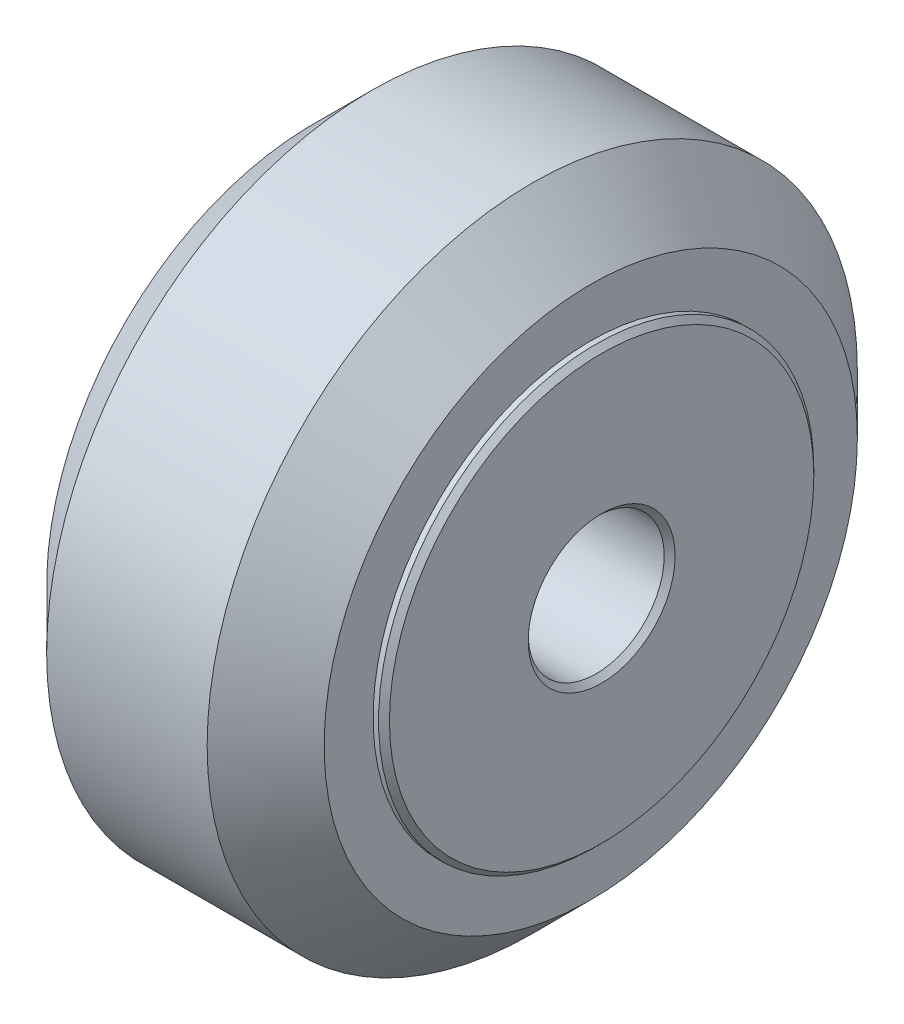
ISO-10303-21;
HEADER;
FILE_DESCRIPTION(('STEP AP214'),'2;1');
FILE_NAME('part.step','',(''),(''),'','','');
FILE_SCHEMA(('AUTOMOTIVE_DESIGN { 1 0 10303 214 1 1 1 1 }'));
ENDSEC;
DATA;
#1=APPLICATION_CONTEXT('core data for automotive mechanical design processes');
#2=APPLICATION_PROTOCOL_DEFINITION('international standard','automotive_design',2000,#1);
#3=PRODUCT_CONTEXT('',#1,'mechanical');
#4=PRODUCT('Part','Part','',(#3));
#5=PRODUCT_RELATED_PRODUCT_CATEGORY('part','',(#4));
#6=PRODUCT_DEFINITION_FORMATION('','',#4);
#7=PRODUCT_DEFINITION_CONTEXT('part definition',#1,'design');
#8=PRODUCT_DEFINITION('design','',#6,#7);
#9=PRODUCT_DEFINITION_SHAPE('','',#8);
#10=(LENGTH_UNIT() NAMED_UNIT(*) SI_UNIT(.MILLI.,.METRE.));
#11=(NAMED_UNIT(*) PLANE_ANGLE_UNIT() SI_UNIT($,.RADIAN.));
#12=(NAMED_UNIT(*) SI_UNIT($,.STERADIAN.) SOLID_ANGLE_UNIT());
#13=UNCERTAINTY_MEASURE_WITH_UNIT(LENGTH_MEASURE(1.E-05),#10,'distance_accuracy_value','');
#14=(GEOMETRIC_REPRESENTATION_CONTEXT(3) GLOBAL_UNCERTAINTY_ASSIGNED_CONTEXT((#13)) GLOBAL_UNIT_ASSIGNED_CONTEXT((#10,
#11,#12)) REPRESENTATION_CONTEXT('',''));
#15=CARTESIAN_POINT('',(0.,0.,0.));
#16=DIRECTION('',(0.,0.,1.));
#17=DIRECTION('',(1.,0.,0.));
#18=AXIS2_PLACEMENT_3D('',#15,#16,#17);
#19=CARTESIAN_POINT('',(-5.50000000000001,0.,0.));
#20=DIRECTION('',(-1.,0.,0.));
#21=DIRECTION('',(0.,0.,1.));
#22=AXIS2_PLACEMENT_3D('',#19,#20,#21);
#23=PLANE('',#22);
#24=CARTESIAN_POINT('',(-5.50000000000001,0.,0.));
#25=DIRECTION('',(-1.,0.,0.));
#26=DIRECTION('',(0.,0.,1.));
#27=AXIS2_PLACEMENT_3D('',#24,#25,#26);
#28=CIRCLE('',#27,2.7);
#29=CARTESIAN_POINT('',(-5.50000000000001,0.,2.7));
#30=VERTEX_POINT('',#29);
#31=EDGE_CURVE('E52',#30,#30,#28,.F.);
#32=ORIENTED_EDGE('',*,*,#31,.T.);
#33=EDGE_LOOP('',(#32));
#34=FACE_BOUND('',#33,.T.);
#35=CARTESIAN_POINT('',(-5.50000000000001,0.,0.));
#36=DIRECTION('',(-1.,0.,0.));
#37=DIRECTION('',(0.,0.,1.));
#38=AXIS2_PLACEMENT_3D('',#35,#36,#37);
#39=CIRCLE('',#38,7.8);
#40=CARTESIAN_POINT('',(-5.50000000000001,0.,7.8));
#41=VERTEX_POINT('',#40);
#42=EDGE_CURVE('E56',#41,#41,#39,.T.);
#43=ORIENTED_EDGE('',*,*,#42,.T.);
#44=EDGE_LOOP('',(#43));
#45=FACE_BOUND('',#44,.T.);
#46=ADVANCED_FACE('F45',(#34,#45),#23,.T.);
#47=CARTESIAN_POINT('',(-0.5,0.,0.));
#48=DIRECTION('',(-1.,0.,0.));
#49=DIRECTION('',(0.,0.,1.));
#50=AXIS2_PLACEMENT_3D('',#47,#48,#49);
#51=PLANE('',#50);
#52=CARTESIAN_POINT('',(-0.5,0.,0.));
#53=DIRECTION('',(-1.,0.,0.));
#54=DIRECTION('',(0.,0.,1.));
#55=AXIS2_PLACEMENT_3D('',#52,#53,#54);
#56=CIRCLE('',#55,8.);
#57=CARTESIAN_POINT('',(-0.5,0.,8.));
#58=VERTEX_POINT('',#57);
#59=EDGE_CURVE('E65',#58,#58,#56,.T.);
#60=ORIENTED_EDGE('',*,*,#59,.F.);
#61=EDGE_LOOP('',(#60));
#62=FACE_BOUND('',#61,.T.);
#63=CARTESIAN_POINT('',(-0.5,0.,0.));
#64=DIRECTION('',(-1.,0.,0.));
#65=DIRECTION('',(0.,0.,1.));
#66=AXIS2_PLACEMENT_3D('',#63,#64,#65);
#67=CIRCLE('',#66,2.5);
#68=CARTESIAN_POINT('',(-0.5,0.,2.5));
#69=VERTEX_POINT('',#68);
#70=EDGE_CURVE('E68',#69,#69,#67,.T.);
#71=ORIENTED_EDGE('',*,*,#70,.T.);
#72=EDGE_LOOP('',(#71));
#73=FACE_BOUND('',#72,.T.);
#74=ADVANCED_FACE('F72',(#62,#73),#51,.F.);
#75=CARTESIAN_POINT('',(-5.50000000000001,0.,0.));
#76=DIRECTION('',(1.,0.,0.));
#77=DIRECTION('',(0.,0.,-1.));
#78=AXIS2_PLACEMENT_3D('',#75,#76,#77);
#79=CYLINDRICAL_SURFACE('',#78,8.);
#80=CARTESIAN_POINT('',(-5.3,0.,0.));
#81=DIRECTION('',(-1.,0.,0.));
#82=DIRECTION('',(0.,0.,1.));
#83=AXIS2_PLACEMENT_3D('',#80,#81,#82);
#84=CIRCLE('',#83,8.);
#85=CARTESIAN_POINT('',(-5.3,0.,8.));
#86=VERTEX_POINT('',#85);
#87=EDGE_CURVE('E11',#86,#86,#84,.F.);
#88=ORIENTED_EDGE('',*,*,#87,.T.);
#89=EDGE_LOOP('',(#88));
#90=FACE_BOUND('',#89,.T.);
#91=ORIENTED_EDGE('',*,*,#59,.T.);
#92=EDGE_LOOP('',(#91));
#93=FACE_BOUND('',#92,.T.);
#94=ADVANCED_FACE('F77',(#90,#93),#79,.T.);
#95=CARTESIAN_POINT('',(-5.50000000000001,0.,0.));
#96=DIRECTION('',(1.,0.,0.));
#97=DIRECTION('',(0.,0.,-1.));
#98=AXIS2_PLACEMENT_3D('',#95,#96,#97);
#99=CYLINDRICAL_SURFACE('',#98,2.5);
#100=CARTESIAN_POINT('',(-5.3,0.,0.));
#101=DIRECTION('',(-1.,0.,0.));
#102=DIRECTION('',(0.,0.,1.));
#103=AXIS2_PLACEMENT_3D('',#100,#101,#102);
#104=CIRCLE('',#103,2.5);
#105=CARTESIAN_POINT('',(-5.3,0.,2.5));
#106=VERTEX_POINT('',#105);
#107=EDGE_CURVE('E60',#106,#106,#104,.T.);
#108=ORIENTED_EDGE('',*,*,#107,.T.);
#109=EDGE_LOOP('',(#108));
#110=FACE_BOUND('',#109,.T.);
#111=ORIENTED_EDGE('',*,*,#70,.F.);
#112=EDGE_LOOP('',(#111));
#113=FACE_BOUND('',#112,.T.);
#114=ADVANCED_FACE('F74',(#110,#113),#99,.F.);
#115=CARTESIAN_POINT('',(-5.3,0.,0.));
#116=DIRECTION('',(-1.,0.,0.));
#117=DIRECTION('',(0.,0.,1.));
#118=AXIS2_PLACEMENT_3D('',#115,#116,#117);
#119=CONICAL_SURFACE('',#118,2.5,0.785398163397449);
#120=ORIENTED_EDGE('',*,*,#31,.F.);
#121=EDGE_LOOP('',(#120));
#122=FACE_BOUND('',#121,.T.);
#123=ORIENTED_EDGE('',*,*,#107,.F.);
#124=EDGE_LOOP('',(#123));
#125=FACE_BOUND('',#124,.T.);
#126=ADVANCED_FACE('F76',(#122,#125),#119,.F.);
#127=CARTESIAN_POINT('',(-5.50000000000001,0.,0.));
#128=DIRECTION('',(1.,0.,0.));
#129=DIRECTION('',(0.,0.,-1.));
#130=AXIS2_PLACEMENT_3D('',#127,#128,#129);
#131=CONICAL_SURFACE('',#130,7.8,0.785398163397457);
#132=ORIENTED_EDGE('',*,*,#87,.F.);
#133=EDGE_LOOP('',(#132));
#134=FACE_BOUND('',#133,.T.);
#135=ORIENTED_EDGE('',*,*,#42,.F.);
#136=EDGE_LOOP('',(#135));
#137=FACE_BOUND('',#136,.T.);
#138=ADVANCED_FACE('F47',(#134,#137),#131,.T.);
#139=CLOSED_SHELL('',(#46,#74,#94,#114,#126,#138));
#140=MANIFOLD_SOLID_BREP('B2',#139);
#141=CARTESIAN_POINT('',(0.5,0.,0.));
#142=DIRECTION('',(1.,0.,0.));
#143=DIRECTION('',(0.,0.,-1.));
#144=AXIS2_PLACEMENT_3D('',#141,#142,#143);
#145=PLANE('',#144);
#146=CARTESIAN_POINT('',(0.5,0.,0.));
#147=DIRECTION('',(1.,0.,0.));
#148=DIRECTION('',(0.,0.,-1.));
#149=AXIS2_PLACEMENT_3D('',#146,#147,#148);
#150=CIRCLE('',#149,5.);
#151=CARTESIAN_POINT('',(0.5,0.,-5.));
#152=VERTEX_POINT('',#151);
#153=EDGE_CURVE('E44',#152,#152,#150,.T.);
#154=ORIENTED_EDGE('',*,*,#153,.T.);
#155=EDGE_LOOP('',(#154));
#156=FACE_BOUND('',#155,.T.);
#157=CARTESIAN_POINT('',(0.5,0.,0.));
#158=DIRECTION('',(1.,0.,0.));
#159=DIRECTION('',(0.,0.,-1.));
#160=AXIS2_PLACEMENT_3D('',#157,#158,#159);
#161=CIRCLE('',#160,2.5);
#162=CARTESIAN_POINT('',(0.5,0.,-2.5));
#163=VERTEX_POINT('',#162);
#164=EDGE_CURVE('E155',#163,#163,#161,.T.);
#165=ORIENTED_EDGE('',*,*,#164,.F.);
#166=EDGE_LOOP('',(#165));
#167=FACE_BOUND('',#166,.T.);
#168=ADVANCED_FACE('F144',(#156,#167),#145,.T.);
#169=CARTESIAN_POINT('',(-0.5,0.,0.));
#170=DIRECTION('',(1.,0.,0.));
#171=DIRECTION('',(0.,0.,-1.));
#172=AXIS2_PLACEMENT_3D('',#169,#170,#171);
#173=PLANE('',#172);
#174=CARTESIAN_POINT('',(-0.5,0.,0.));
#175=DIRECTION('',(1.,0.,0.));
#176=DIRECTION('',(0.,0.,-1.));
#177=AXIS2_PLACEMENT_3D('',#174,#175,#176);
#178=CIRCLE('',#177,5.);
#179=CARTESIAN_POINT('',(-0.5,0.,-5.));
#180=VERTEX_POINT('',#179);
#181=EDGE_CURVE('E148',#180,#180,#178,.T.);
#182=ORIENTED_EDGE('',*,*,#181,.F.);
#183=EDGE_LOOP('',(#182));
#184=FACE_BOUND('',#183,.T.);
#185=CARTESIAN_POINT('',(-0.5,0.,0.));
#186=DIRECTION('',(1.,0.,0.));
#187=DIRECTION('',(0.,0.,-1.));
#188=AXIS2_PLACEMENT_3D('',#185,#186,#187);
#189=CIRCLE('',#188,2.5);
#190=CARTESIAN_POINT('',(-0.5,0.,-2.5));
#191=VERTEX_POINT('',#190);
#192=EDGE_CURVE('E157',#191,#191,#189,.T.);
#193=ORIENTED_EDGE('',*,*,#192,.T.);
#194=EDGE_LOOP('',(#193));
#195=FACE_BOUND('',#194,.T.);
#196=ADVANCED_FACE('F167',(#184,#195),#173,.F.);
#197=CARTESIAN_POINT('',(0.5,0.,0.));
#198=DIRECTION('',(-1.,0.,0.));
#199=DIRECTION('',(0.,0.,1.));
#200=AXIS2_PLACEMENT_3D('',#197,#198,#199);
#201=CYLINDRICAL_SURFACE('',#200,5.);
#202=ORIENTED_EDGE('',*,*,#153,.F.);
#203=EDGE_LOOP('',(#202));
#204=FACE_BOUND('',#203,.T.);
#205=ORIENTED_EDGE('',*,*,#181,.T.);
#206=EDGE_LOOP('',(#205));
#207=FACE_BOUND('',#206,.T.);
#208=ADVANCED_FACE('F146',(#204,#207),#201,.T.);
#209=CARTESIAN_POINT('',(0.5,0.,0.));
#210=DIRECTION('',(-1.,0.,0.));
#211=DIRECTION('',(0.,0.,1.));
#212=AXIS2_PLACEMENT_3D('',#209,#210,#211);
#213=CYLINDRICAL_SURFACE('',#212,2.5);
#214=ORIENTED_EDGE('',*,*,#164,.T.);
#215=EDGE_LOOP('',(#214));
#216=FACE_BOUND('',#215,.T.);
#217=ORIENTED_EDGE('',*,*,#192,.F.);
#218=EDGE_LOOP('',(#217));
#219=FACE_BOUND('',#218,.T.);
#220=ADVANCED_FACE('F163',(#216,#219),#213,.F.);
#221=CLOSED_SHELL('',(#168,#196,#208,#220));
#222=MANIFOLD_SOLID_BREP('B6',#221);
#223=CARTESIAN_POINT('',(5.50000000000001,0.,0.));
#224=DIRECTION('',(1.,0.,0.));
#225=DIRECTION('',(0.,0.,-1.));
#226=AXIS2_PLACEMENT_3D('',#223,#224,#225);
#227=PLANE('',#226);
#228=CARTESIAN_POINT('',(5.50000000000001,0.,0.));
#229=DIRECTION('',(1.,0.,0.));
#230=DIRECTION('',(0.,0.,-1.));
#231=AXIS2_PLACEMENT_3D('',#228,#229,#230);
#232=CIRCLE('',#231,2.7);
#233=CARTESIAN_POINT('',(5.50000000000001,0.,-2.7));
#234=VERTEX_POINT('',#233);
#235=EDGE_CURVE('E219',#234,#234,#232,.F.);
#236=ORIENTED_EDGE('',*,*,#235,.T.);
#237=EDGE_LOOP('',(#236));
#238=FACE_BOUND('',#237,.T.);
#239=CARTESIAN_POINT('',(5.50000000000001,0.,0.));
#240=DIRECTION('',(1.,0.,0.));
#241=DIRECTION('',(0.,0.,-1.));
#242=AXIS2_PLACEMENT_3D('',#239,#240,#241);
#243=CIRCLE('',#242,7.8);
#244=CARTESIAN_POINT('',(5.50000000000001,0.,-7.8));
#245=VERTEX_POINT('',#244);
#246=EDGE_CURVE('E223',#245,#245,#243,.T.);
#247=ORIENTED_EDGE('',*,*,#246,.T.);
#248=EDGE_LOOP('',(#247));
#249=FACE_BOUND('',#248,.T.);
#250=ADVANCED_FACE('F212',(#238,#249),#227,.T.);
#251=CARTESIAN_POINT('',(0.5,0.,0.));
#252=DIRECTION('',(1.,0.,0.));
#253=DIRECTION('',(0.,0.,-1.));
#254=AXIS2_PLACEMENT_3D('',#251,#252,#253);
#255=PLANE('',#254);
#256=CARTESIAN_POINT('',(0.5,0.,0.));
#257=DIRECTION('',(1.,0.,0.));
#258=DIRECTION('',(0.,0.,-1.));
#259=AXIS2_PLACEMENT_3D('',#256,#257,#258);
#260=CIRCLE('',#259,8.);
#261=CARTESIAN_POINT('',(0.5,0.,-8.));
#262=VERTEX_POINT('',#261);
#263=EDGE_CURVE('E232',#262,#262,#260,.T.);
#264=ORIENTED_EDGE('',*,*,#263,.F.);
#265=EDGE_LOOP('',(#264));
#266=FACE_BOUND('',#265,.T.);
#267=CARTESIAN_POINT('',(0.5,0.,0.));
#268=DIRECTION('',(1.,0.,0.));
#269=DIRECTION('',(0.,0.,-1.));
#270=AXIS2_PLACEMENT_3D('',#267,#268,#269);
#271=CIRCLE('',#270,2.5);
#272=CARTESIAN_POINT('',(0.5,0.,-2.5));
#273=VERTEX_POINT('',#272);
#274=EDGE_CURVE('E235',#273,#273,#271,.T.);
#275=ORIENTED_EDGE('',*,*,#274,.T.);
#276=EDGE_LOOP('',(#275));
#277=FACE_BOUND('',#276,.T.);
#278=ADVANCED_FACE('F239',(#266,#277),#255,.F.);
#279=CARTESIAN_POINT('',(5.50000000000001,0.,0.));
#280=DIRECTION('',(-1.,0.,0.));
#281=DIRECTION('',(0.,0.,1.));
#282=AXIS2_PLACEMENT_3D('',#279,#280,#281);
#283=CYLINDRICAL_SURFACE('',#282,8.);
#284=CARTESIAN_POINT('',(5.3,0.,0.));
#285=DIRECTION('',(1.,0.,0.));
#286=DIRECTION('',(0.,0.,-1.));
#287=AXIS2_PLACEMENT_3D('',#284,#285,#286);
#288=CIRCLE('',#287,8.);
#289=CARTESIAN_POINT('',(5.3,0.,-8.));
#290=VERTEX_POINT('',#289);
#291=EDGE_CURVE('E143',#290,#290,#288,.F.);
#292=ORIENTED_EDGE('',*,*,#291,.T.);
#293=EDGE_LOOP('',(#292));
#294=FACE_BOUND('',#293,.T.);
#295=ORIENTED_EDGE('',*,*,#263,.T.);
#296=EDGE_LOOP('',(#295));
#297=FACE_BOUND('',#296,.T.);
#298=ADVANCED_FACE('F244',(#294,#297),#283,.T.);
#299=CARTESIAN_POINT('',(5.50000000000001,0.,0.));
#300=DIRECTION('',(-1.,0.,0.));
#301=DIRECTION('',(0.,0.,1.));
#302=AXIS2_PLACEMENT_3D('',#299,#300,#301);
#303=CYLINDRICAL_SURFACE('',#302,2.5);
#304=CARTESIAN_POINT('',(5.3,0.,0.));
#305=DIRECTION('',(1.,0.,0.));
#306=DIRECTION('',(0.,0.,-1.));
#307=AXIS2_PLACEMENT_3D('',#304,#305,#306);
#308=CIRCLE('',#307,2.5);
#309=CARTESIAN_POINT('',(5.3,0.,-2.5));
#310=VERTEX_POINT('',#309);
#311=EDGE_CURVE('E227',#310,#310,#308,.T.);
#312=ORIENTED_EDGE('',*,*,#311,.T.);
#313=EDGE_LOOP('',(#312));
#314=FACE_BOUND('',#313,.T.);
#315=ORIENTED_EDGE('',*,*,#274,.F.);
#316=EDGE_LOOP('',(#315));
#317=FACE_BOUND('',#316,.T.);
#318=ADVANCED_FACE('F241',(#314,#317),#303,.F.);
#319=CARTESIAN_POINT('',(5.3,0.,0.));
#320=DIRECTION('',(1.,0.,0.));
#321=DIRECTION('',(0.,0.,-1.));
#322=AXIS2_PLACEMENT_3D('',#319,#320,#321);
#323=CONICAL_SURFACE('',#322,2.5,0.785398163397449);
#324=ORIENTED_EDGE('',*,*,#235,.F.);
#325=EDGE_LOOP('',(#324));
#326=FACE_BOUND('',#325,.T.);
#327=ORIENTED_EDGE('',*,*,#311,.F.);
#328=EDGE_LOOP('',(#327));
#329=FACE_BOUND('',#328,.T.);
#330=ADVANCED_FACE('F243',(#326,#329),#323,.F.);
#331=CARTESIAN_POINT('',(5.50000000000001,0.,0.));
#332=DIRECTION('',(-1.,0.,0.));
#333=DIRECTION('',(0.,0.,1.));
#334=AXIS2_PLACEMENT_3D('',#331,#332,#333);
#335=CONICAL_SURFACE('',#334,7.8,0.785398163397457);
#336=ORIENTED_EDGE('',*,*,#291,.F.);
#337=EDGE_LOOP('',(#336));
#338=FACE_BOUND('',#337,.T.);
#339=ORIENTED_EDGE('',*,*,#246,.F.);
#340=EDGE_LOOP('',(#339));
#341=FACE_BOUND('',#340,.T.);
#342=ADVANCED_FACE('F214',(#338,#341),#335,.T.);
#343=CLOSED_SHELL('',(#250,#278,#298,#318,#330,#342));
#344=MANIFOLD_SOLID_BREP('B39',#343);
#345=CARTESIAN_POINT('',(-5.09999999999999,0.,0.));
#346=DIRECTION('',(1.,0.,0.));
#347=DIRECTION('',(0.,0.,-1.));
#348=AXIS2_PLACEMENT_3D('',#345,#346,#347);
#349=CYLINDRICAL_SURFACE('',#348,8.);
#350=CARTESIAN_POINT('',(-0.5,0.,0.));
#351=DIRECTION('',(1.,0.,0.));
#352=DIRECTION('',(0.,0.,-1.));
#353=AXIS2_PLACEMENT_3D('',#350,#351,#352);
#354=CIRCLE('',#353,8.);
#355=CARTESIAN_POINT('',(-0.5,0.,-8.));
#356=VERTEX_POINT('',#355);
#357=EDGE_CURVE('E337',#356,#356,#354,.T.);
#358=ORIENTED_EDGE('',*,*,#357,.T.);
#359=EDGE_LOOP('',(#358));
#360=FACE_BOUND('',#359,.T.);
#361=CARTESIAN_POINT('',(-5.09999999999999,0.,0.));
#362=DIRECTION('',(1.,0.,0.));
#363=DIRECTION('',(0.,0.,-1.));
#364=AXIS2_PLACEMENT_3D('',#361,#362,#363);
#365=CIRCLE('',#364,8.);
#366=CARTESIAN_POINT('',(-5.09999999999999,0.,-8.));
#367=VERTEX_POINT('',#366);
#368=EDGE_CURVE('E211',#367,#367,#365,.T.);
#369=ORIENTED_EDGE('',*,*,#368,.F.);
#370=EDGE_LOOP('',(#369));
#371=FACE_BOUND('',#370,.T.);
#372=ADVANCED_FACE('F303',(#360,#371),#349,.F.);
#373=CARTESIAN_POINT('',(-5.10000000000005,9.80000000000001,0.));
#374=DIRECTION('',(-1.,0.,0.));
#375=DIRECTION('',(0.,0.,1.));
#376=AXIS2_PLACEMENT_3D('',#373,#374,#375);
#377=PLANE('',#376);
#378=ORIENTED_EDGE('',*,*,#368,.T.);
#379=EDGE_LOOP('',(#378));
#380=FACE_BOUND('',#379,.T.);
#381=CARTESIAN_POINT('',(-5.09999999999999,0.,0.));
#382=DIRECTION('',(1.,0.,0.));
#383=DIRECTION('',(0.,0.,-1.));
#384=AXIS2_PLACEMENT_3D('',#381,#382,#383);
#385=CIRCLE('',#384,9.80000000000001);
#386=CARTESIAN_POINT('',(-5.09999999999999,0.,-9.80000000000001));
#387=VERTEX_POINT('',#386);
#388=EDGE_CURVE('E309',#387,#387,#385,.T.);
#389=ORIENTED_EDGE('',*,*,#388,.F.);
#390=EDGE_LOOP('',(#389));
#391=FACE_BOUND('',#390,.T.);
#392=ADVANCED_FACE('F355',(#380,#391),#377,.T.);
#393=CARTESIAN_POINT('',(-2.95000000000001,0.,0.));
#394=DIRECTION('',(1.,0.,0.));
#395=DIRECTION('',(0.,0.,-1.));
#396=AXIS2_PLACEMENT_3D('',#393,#394,#395);
#397=CONICAL_SURFACE('',#396,11.95,0.785398163397447);
#398=ORIENTED_EDGE('',*,*,#388,.T.);
#399=EDGE_LOOP('',(#398));
#400=FACE_BOUND('',#399,.T.);
#401=CARTESIAN_POINT('',(-2.95000000000001,0.,0.));
#402=DIRECTION('',(1.,0.,0.));
#403=DIRECTION('',(0.,0.,-1.));
#404=AXIS2_PLACEMENT_3D('',#401,#402,#403);
#405=CIRCLE('',#404,11.95);
#406=CARTESIAN_POINT('',(-2.95000000000001,0.,-11.95));
#407=VERTEX_POINT('',#406);
#408=EDGE_CURVE('E313',#407,#407,#405,.T.);
#409=ORIENTED_EDGE('',*,*,#408,.F.);
#410=EDGE_LOOP('',(#409));
#411=FACE_BOUND('',#410,.T.);
#412=ADVANCED_FACE('F359',(#400,#411),#397,.T.);
#413=CARTESIAN_POINT('',(-5.09999999999999,0.,0.));
#414=DIRECTION('',(1.,0.,0.));
#415=DIRECTION('',(0.,0.,-1.));
#416=AXIS2_PLACEMENT_3D('',#413,#414,#415);
#417=CYLINDRICAL_SURFACE('',#416,11.95);
#418=ORIENTED_EDGE('',*,*,#408,.T.);
#419=EDGE_LOOP('',(#418));
#420=FACE_BOUND('',#419,.T.);
#421=CARTESIAN_POINT('',(2.95000000000001,0.,0.));
#422=DIRECTION('',(1.,0.,0.));
#423=DIRECTION('',(0.,0.,-1.));
#424=AXIS2_PLACEMENT_3D('',#421,#422,#423);
#425=CIRCLE('',#424,11.95);
#426=CARTESIAN_POINT('',(2.95000000000001,0.,-11.95));
#427=VERTEX_POINT('',#426);
#428=EDGE_CURVE('E317',#427,#427,#425,.T.);
#429=ORIENTED_EDGE('',*,*,#428,.F.);
#430=EDGE_LOOP('',(#429));
#431=FACE_BOUND('',#430,.T.);
#432=ADVANCED_FACE('F363',(#420,#431),#417,.T.);
#433=CARTESIAN_POINT('',(5.09999999999999,0.,0.));
#434=DIRECTION('',(-1.,0.,0.));
#435=DIRECTION('',(0.,0.,1.));
#436=AXIS2_PLACEMENT_3D('',#433,#434,#435);
#437=CONICAL_SURFACE('',#436,9.80000000000001,0.785398163397446);
#438=ORIENTED_EDGE('',*,*,#428,.T.);
#439=EDGE_LOOP('',(#438));
#440=FACE_BOUND('',#439,.T.);
#441=CARTESIAN_POINT('',(5.09999999999999,0.,0.));
#442=DIRECTION('',(1.,0.,0.));
#443=DIRECTION('',(0.,0.,-1.));
#444=AXIS2_PLACEMENT_3D('',#441,#442,#443);
#445=CIRCLE('',#444,9.80000000000001);
#446=CARTESIAN_POINT('',(5.09999999999999,0.,-9.80000000000001));
#447=VERTEX_POINT('',#446);
#448=EDGE_CURVE('E322',#447,#447,#445,.T.);
#449=ORIENTED_EDGE('',*,*,#448,.F.);
#450=EDGE_LOOP('',(#449));
#451=FACE_BOUND('',#450,.T.);
#452=ADVANCED_FACE('F369',(#440,#451),#437,.T.);
#453=CARTESIAN_POINT('',(5.09999999999999,8.00000000000002,0.));
#454=DIRECTION('',(1.,0.,0.));
#455=DIRECTION('',(0.,0.,-1.));
#456=AXIS2_PLACEMENT_3D('',#453,#454,#455);
#457=PLANE('',#456);
#458=ORIENTED_EDGE('',*,*,#448,.T.);
#459=EDGE_LOOP('',(#458));
#460=FACE_BOUND('',#459,.T.);
#461=CARTESIAN_POINT('',(5.09999999999999,0.,0.));
#462=DIRECTION('',(1.,0.,0.));
#463=DIRECTION('',(0.,0.,-1.));
#464=AXIS2_PLACEMENT_3D('',#461,#462,#463);
#465=CIRCLE('',#464,8.);
#466=CARTESIAN_POINT('',(5.09999999999999,0.,-8.));
#467=VERTEX_POINT('',#466);
#468=EDGE_CURVE('E325',#467,#467,#465,.T.);
#469=ORIENTED_EDGE('',*,*,#468,.F.);
#470=EDGE_LOOP('',(#469));
#471=FACE_BOUND('',#470,.T.);
#472=ADVANCED_FACE('F373',(#460,#471),#457,.T.);
#473=CARTESIAN_POINT('',(-5.09999999999999,0.,0.));
#474=DIRECTION('',(1.,0.,0.));
#475=DIRECTION('',(0.,0.,-1.));
#476=AXIS2_PLACEMENT_3D('',#473,#474,#475);
#477=CYLINDRICAL_SURFACE('',#476,8.);
#478=ORIENTED_EDGE('',*,*,#468,.T.);
#479=EDGE_LOOP('',(#478));
#480=FACE_BOUND('',#479,.T.);
#481=CARTESIAN_POINT('',(0.5,0.,0.));
#482=DIRECTION('',(1.,0.,0.));
#483=DIRECTION('',(0.,0.,-1.));
#484=AXIS2_PLACEMENT_3D('',#481,#482,#483);
#485=CIRCLE('',#484,8.);
#486=CARTESIAN_POINT('',(0.5,0.,-8.));
#487=VERTEX_POINT('',#486);
#488=EDGE_CURVE('E328',#487,#487,#485,.T.);
#489=ORIENTED_EDGE('',*,*,#488,.F.);
#490=EDGE_LOOP('',(#489));
#491=FACE_BOUND('',#490,.T.);
#492=ADVANCED_FACE('F377',(#480,#491),#477,.F.);
#493=CARTESIAN_POINT('',(0.5,7.00000000000001,0.));
#494=DIRECTION('',(1.,0.,0.));
#495=DIRECTION('',(0.,0.,-1.));
#496=AXIS2_PLACEMENT_3D('',#493,#494,#495);
#497=PLANE('',#496);
#498=ORIENTED_EDGE('',*,*,#488,.T.);
#499=EDGE_LOOP('',(#498));
#500=FACE_BOUND('',#499,.T.);
#501=CARTESIAN_POINT('',(0.5,0.,0.));
#502=DIRECTION('',(1.,0.,0.));
#503=DIRECTION('',(0.,0.,-1.));
#504=AXIS2_PLACEMENT_3D('',#501,#502,#503);
#505=CIRCLE('',#504,7.);
#506=CARTESIAN_POINT('',(0.5,0.,-7.));
#507=VERTEX_POINT('',#506);
#508=EDGE_CURVE('E331',#507,#507,#505,.T.);
#509=ORIENTED_EDGE('',*,*,#508,.F.);
#510=EDGE_LOOP('',(#509));
#511=FACE_BOUND('',#510,.T.);
#512=ADVANCED_FACE('F351',(#500,#511),#497,.T.);
#513=CARTESIAN_POINT('',(-5.09999999999999,0.,0.));
#514=DIRECTION('',(1.,0.,0.));
#515=DIRECTION('',(0.,0.,-1.));
#516=AXIS2_PLACEMENT_3D('',#513,#514,#515);
#517=CYLINDRICAL_SURFACE('',#516,7.);
#518=ORIENTED_EDGE('',*,*,#508,.T.);
#519=EDGE_LOOP('',(#518));
#520=FACE_BOUND('',#519,.T.);
#521=CARTESIAN_POINT('',(-0.5,0.,0.));
#522=DIRECTION('',(1.,0.,0.));
#523=DIRECTION('',(0.,0.,-1.));
#524=AXIS2_PLACEMENT_3D('',#521,#522,#523);
#525=CIRCLE('',#524,7.);
#526=CARTESIAN_POINT('',(-0.5,0.,-7.));
#527=VERTEX_POINT('',#526);
#528=EDGE_CURVE('E334',#527,#527,#525,.T.);
#529=ORIENTED_EDGE('',*,*,#528,.F.);
#530=EDGE_LOOP('',(#529));
#531=FACE_BOUND('',#530,.T.);
#532=ADVANCED_FACE('F345',(#520,#531),#517,.F.);
#533=CARTESIAN_POINT('',(-0.500000000000056,8.00000000000004,0.));
#534=DIRECTION('',(-1.,0.,0.));
#535=DIRECTION('',(0.,0.,1.));
#536=AXIS2_PLACEMENT_3D('',#533,#534,#535);
#537=PLANE('',#536);
#538=ORIENTED_EDGE('',*,*,#528,.T.);
#539=EDGE_LOOP('',(#538));
#540=FACE_BOUND('',#539,.T.);
#541=ORIENTED_EDGE('',*,*,#357,.F.);
#542=EDGE_LOOP('',(#541));
#543=FACE_BOUND('',#542,.T.);
#544=ADVANCED_FACE('F343',(#540,#543),#537,.T.);
#545=CLOSED_SHELL('',(#372,#392,#412,#432,#452,#472,#492,#512,#532,#544));
#546=MANIFOLD_SOLID_BREP('B138',#545);
#547=ADVANCED_BREP_SHAPE_REPRESENTATION('',(#18,#140,#222,#344,#546),#14);
#548=SHAPE_DEFINITION_REPRESENTATION(#9,#547);
ENDSEC;
END-ISO-10303-21;
